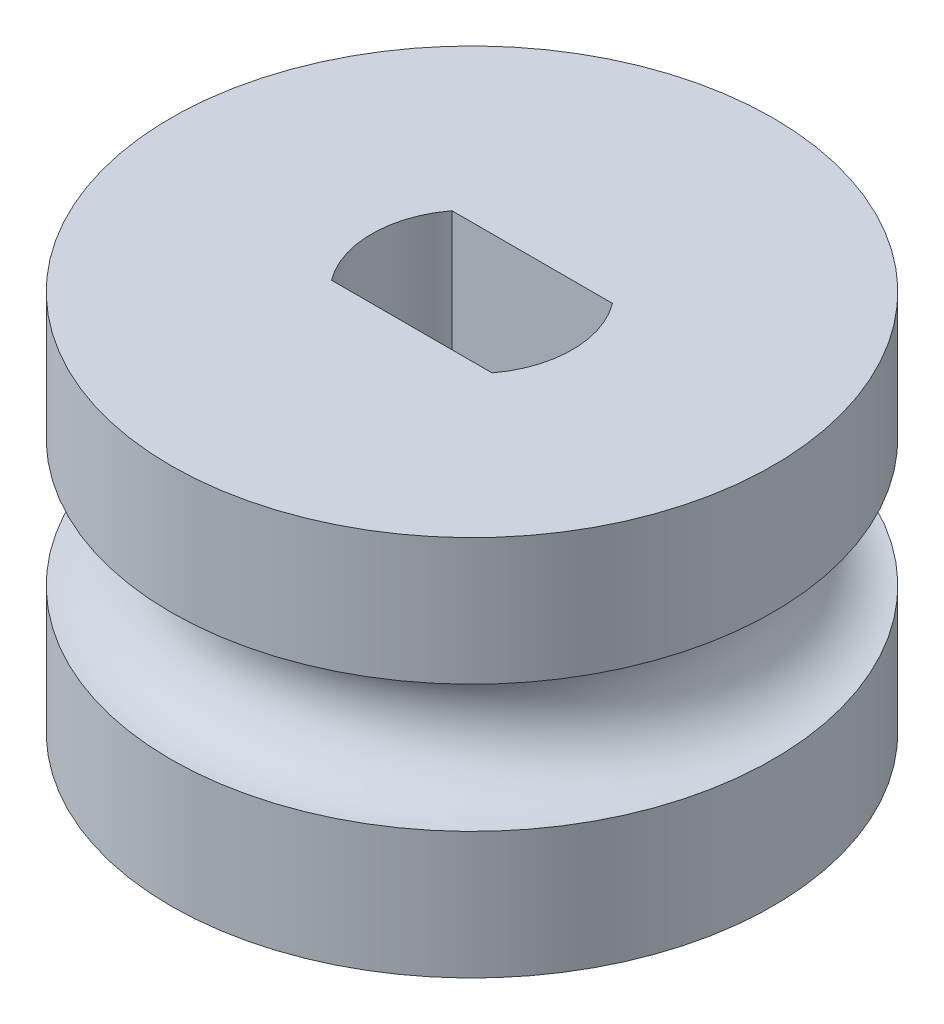
ISO-10303-21;
HEADER;
FILE_DESCRIPTION(('STEP AP214'),'2;1');
FILE_NAME('part.step','',(''),(''),'','','');
FILE_SCHEMA(('AUTOMOTIVE_DESIGN { 1 0 10303 214 1 1 1 1 }'));
ENDSEC;
DATA;
#1=APPLICATION_CONTEXT('core data for automotive mechanical design processes');
#2=APPLICATION_PROTOCOL_DEFINITION('international standard','automotive_design',2000,#1);
#3=PRODUCT_CONTEXT('',#1,'mechanical');
#4=PRODUCT('Part','Part','',(#3));
#5=PRODUCT_RELATED_PRODUCT_CATEGORY('part','',(#4));
#6=PRODUCT_DEFINITION_FORMATION('','',#4);
#7=PRODUCT_DEFINITION_CONTEXT('part definition',#1,'design');
#8=PRODUCT_DEFINITION('design','',#6,#7);
#9=PRODUCT_DEFINITION_SHAPE('','',#8);
#10=(LENGTH_UNIT() NAMED_UNIT(*) SI_UNIT(.MILLI.,.METRE.));
#11=(NAMED_UNIT(*) PLANE_ANGLE_UNIT() SI_UNIT($,.RADIAN.));
#12=(NAMED_UNIT(*) SI_UNIT($,.STERADIAN.) SOLID_ANGLE_UNIT());
#13=UNCERTAINTY_MEASURE_WITH_UNIT(LENGTH_MEASURE(1.E-05),#10,'distance_accuracy_value','');
#14=(GEOMETRIC_REPRESENTATION_CONTEXT(3) GLOBAL_UNCERTAINTY_ASSIGNED_CONTEXT((#13)) GLOBAL_UNIT_ASSIGNED_CONTEXT((#10,
#11,#12)) REPRESENTATION_CONTEXT('',''));
#15=CARTESIAN_POINT('',(0.,0.,0.));
#16=DIRECTION('',(0.,0.,1.));
#17=DIRECTION('',(1.,0.,0.));
#18=AXIS2_PLACEMENT_3D('',#15,#16,#17);
#19=CARTESIAN_POINT('',(0.,9.5,0.));
#20=DIRECTION('',(0.,-1.,0.));
#21=DIRECTION('',(0.,0.,-1.));
#22=AXIS2_PLACEMENT_3D('',#19,#20,#21);
#23=CYLINDRICAL_SURFACE('',#22,7.5);
#24=CARTESIAN_POINT('',(0.,9.5,0.));
#25=DIRECTION('',(0.,1.,0.));
#26=DIRECTION('',(0.,0.,1.));
#27=AXIS2_PLACEMENT_3D('',#24,#25,#26);
#28=CIRCLE('',#27,7.5);
#29=CARTESIAN_POINT('',(0.,9.5,7.5));
#30=VERTEX_POINT('',#29);
#31=EDGE_CURVE('E11',#30,#30,#28,.T.);
#32=ORIENTED_EDGE('',*,*,#31,.F.);
#33=EDGE_LOOP('',(#32));
#34=FACE_BOUND('',#33,.T.);
#35=CARTESIAN_POINT('',(0.,6.3375,0.));
#36=DIRECTION('',(0.,-1.,0.));
#37=DIRECTION('',(0.,0.,-1.));
#38=AXIS2_PLACEMENT_3D('',#35,#36,#37);
#39=CIRCLE('',#38,7.5);
#40=CARTESIAN_POINT('',(0.,6.3375,-7.5));
#41=VERTEX_POINT('',#40);
#42=EDGE_CURVE('E36',#41,#41,#39,.T.);
#43=ORIENTED_EDGE('',*,*,#42,.F.);
#44=EDGE_LOOP('',(#43));
#45=FACE_BOUND('',#44,.T.);
#46=ADVANCED_FACE('F33',(#34,#45),#23,.T.);
#47=CARTESIAN_POINT('',(0.,0.,0.));
#48=DIRECTION('',(0.,1.,0.));
#49=DIRECTION('',(0.,0.,1.));
#50=AXIS2_PLACEMENT_3D('',#47,#48,#49);
#51=CIRCLE('',#50,7.5);
#52=CARTESIAN_POINT('',(0.,0.,7.5));
#53=VERTEX_POINT('',#52);
#54=EDGE_CURVE('E41',#53,#53,#51,.T.);
#55=ORIENTED_EDGE('',*,*,#54,.T.);
#56=EDGE_LOOP('',(#55));
#57=FACE_BOUND('',#56,.T.);
#58=CARTESIAN_POINT('',(0.,3.1625,0.));
#59=DIRECTION('',(0.,1.,0.));
#60=DIRECTION('',(0.,0.,1.));
#61=AXIS2_PLACEMENT_3D('',#58,#59,#60);
#62=CIRCLE('',#61,7.5);
#63=CARTESIAN_POINT('',(0.,3.1625,7.5));
#64=VERTEX_POINT('',#63);
#65=EDGE_CURVE('E112',#64,#64,#62,.T.);
#66=ORIENTED_EDGE('',*,*,#65,.F.);
#67=EDGE_LOOP('',(#66));
#68=FACE_BOUND('',#67,.T.);
#69=ADVANCED_FACE('F122',(#57,#68),#23,.T.);
#70=CARTESIAN_POINT('',(0.,9.5,0.));
#71=DIRECTION('',(0.,1.,0.));
#72=DIRECTION('',(0.,0.,1.));
#73=AXIS2_PLACEMENT_3D('',#70,#71,#72);
#74=PLANE('',#73);
#75=ORIENTED_EDGE('',*,*,#31,.T.);
#76=EDGE_LOOP('',(#75));
#77=FACE_BOUND('',#76,.T.);
#78=DIRECTION('',(1.,0.,0.));
#79=VECTOR('',#78,1.);
#80=CARTESIAN_POINT('',(-2.,9.5,1.5));
#81=LINE('',#80,#79);
#82=CARTESIAN_POINT('',(-2.,9.5,1.5));
#83=VERTEX_POINT('',#82);
#84=CARTESIAN_POINT('',(2.,9.5,1.5));
#85=VERTEX_POINT('',#84);
#86=EDGE_CURVE('E83',#83,#85,#81,.T.);
#87=ORIENTED_EDGE('',*,*,#86,.F.);
#88=CARTESIAN_POINT('',(0.,9.5,0.));
#89=DIRECTION('',(0.,1.,0.));
#90=DIRECTION('',(0.,0.,1.));
#91=AXIS2_PLACEMENT_3D('',#88,#89,#90);
#92=CIRCLE('',#91,2.5);
#93=CARTESIAN_POINT('',(-2.,9.5,-1.5));
#94=VERTEX_POINT('',#93);
#95=EDGE_CURVE('E75',#94,#83,#92,.T.);
#96=ORIENTED_EDGE('',*,*,#95,.F.);
#97=DIRECTION('',(-1.,0.,0.));
#98=VECTOR('',#97,1.);
#99=CARTESIAN_POINT('',(-2.,9.5,-1.5));
#100=LINE('',#99,#98);
#101=CARTESIAN_POINT('',(2.,9.5,-1.5));
#102=VERTEX_POINT('',#101);
#103=EDGE_CURVE('E97',#102,#94,#100,.T.);
#104=ORIENTED_EDGE('',*,*,#103,.F.);
#105=CARTESIAN_POINT('',(0.,9.5,0.));
#106=DIRECTION('',(0.,1.,0.));
#107=DIRECTION('',(0.,0.,1.));
#108=AXIS2_PLACEMENT_3D('',#105,#106,#107);
#109=CIRCLE('',#108,2.5);
#110=EDGE_CURVE('E95',#85,#102,#109,.T.);
#111=ORIENTED_EDGE('',*,*,#110,.F.);
#112=EDGE_LOOP('',(#87,#96,#104,#111));
#113=FACE_BOUND('',#112,.T.);
#114=ADVANCED_FACE('F94',(#77,#113),#74,.T.);
#115=CARTESIAN_POINT('',(0.,0.,0.));
#116=DIRECTION('',(0.,1.,0.));
#117=DIRECTION('',(0.,0.,1.));
#118=AXIS2_PLACEMENT_3D('',#115,#116,#117);
#119=PLANE('',#118);
#120=ORIENTED_EDGE('',*,*,#54,.F.);
#121=EDGE_LOOP('',(#120));
#122=FACE_BOUND('',#121,.T.);
#123=CARTESIAN_POINT('',(0.,0.,0.));
#124=DIRECTION('',(0.,1.,0.));
#125=DIRECTION('',(0.,0.,1.));
#126=AXIS2_PLACEMENT_3D('',#123,#124,#125);
#127=CIRCLE('',#126,2.5);
#128=CARTESIAN_POINT('',(-2.,0.,-1.5));
#129=VERTEX_POINT('',#128);
#130=CARTESIAN_POINT('',(-2.,0.,1.5));
#131=VERTEX_POINT('',#130);
#132=EDGE_CURVE('E57',#129,#131,#127,.T.);
#133=ORIENTED_EDGE('',*,*,#132,.T.);
#134=DIRECTION('',(1.,0.,0.));
#135=VECTOR('',#134,1.);
#136=CARTESIAN_POINT('',(-2.,0.,1.5));
#137=LINE('',#136,#135);
#138=CARTESIAN_POINT('',(2.,0.,1.5));
#139=VERTEX_POINT('',#138);
#140=EDGE_CURVE('E90',#131,#139,#137,.T.);
#141=ORIENTED_EDGE('',*,*,#140,.T.);
#142=CARTESIAN_POINT('',(0.,0.,0.));
#143=DIRECTION('',(0.,1.,0.));
#144=DIRECTION('',(0.,0.,1.));
#145=AXIS2_PLACEMENT_3D('',#142,#143,#144);
#146=CIRCLE('',#145,2.5);
#147=CARTESIAN_POINT('',(2.,0.,-1.5));
#148=VERTEX_POINT('',#147);
#149=EDGE_CURVE('E103',#139,#148,#146,.T.);
#150=ORIENTED_EDGE('',*,*,#149,.T.);
#151=DIRECTION('',(-1.,0.,0.));
#152=VECTOR('',#151,1.);
#153=CARTESIAN_POINT('',(-2.,0.,-1.5));
#154=LINE('',#153,#152);
#155=EDGE_CURVE('E84',#148,#129,#154,.T.);
#156=ORIENTED_EDGE('',*,*,#155,.T.);
#157=EDGE_LOOP('',(#133,#141,#150,#156));
#158=FACE_BOUND('',#157,.T.);
#159=ADVANCED_FACE('F131',(#122,#158),#119,.F.);
#160=CARTESIAN_POINT('',(0.,9.5,0.));
#161=DIRECTION('',(0.,-1.,0.));
#162=DIRECTION('',(0.,0.,-1.));
#163=AXIS2_PLACEMENT_3D('',#160,#161,#162);
#164=CYLINDRICAL_SURFACE('',#163,2.5);
#165=ORIENTED_EDGE('',*,*,#132,.F.);
#166=DIRECTION('',(0.,-1.,0.));
#167=VECTOR('',#166,1.);
#168=CARTESIAN_POINT('',(-2.,9.5,-1.5));
#169=LINE('',#168,#167);
#170=EDGE_CURVE('E79',#94,#129,#169,.T.);
#171=ORIENTED_EDGE('',*,*,#170,.F.);
#172=ORIENTED_EDGE('',*,*,#95,.T.);
#173=DIRECTION('',(0.,-1.,0.));
#174=VECTOR('',#173,1.);
#175=CARTESIAN_POINT('',(-2.,9.5,1.5));
#176=LINE('',#175,#174);
#177=EDGE_CURVE('E78',#83,#131,#176,.T.);
#178=ORIENTED_EDGE('',*,*,#177,.T.);
#179=EDGE_LOOP('',(#165,#171,#172,#178));
#180=FACE_BOUND('',#179,.T.);
#181=ADVANCED_FACE('F77',(#180),#164,.F.);
#182=CARTESIAN_POINT('',(-2.,9.5,1.5));
#183=DIRECTION('',(0.,0.,-1.));
#184=DIRECTION('',(-1.,0.,0.));
#185=AXIS2_PLACEMENT_3D('',#182,#183,#184);
#186=PLANE('',#185);
#187=ORIENTED_EDGE('',*,*,#140,.F.);
#188=ORIENTED_EDGE('',*,*,#177,.F.);
#189=ORIENTED_EDGE('',*,*,#86,.T.);
#190=DIRECTION('',(0.,-1.,0.));
#191=VECTOR('',#190,1.);
#192=CARTESIAN_POINT('',(2.,9.5,1.5));
#193=LINE('',#192,#191);
#194=EDGE_CURVE('E91',#85,#139,#193,.T.);
#195=ORIENTED_EDGE('',*,*,#194,.T.);
#196=EDGE_LOOP('',(#187,#188,#189,#195));
#197=FACE_BOUND('',#196,.T.);
#198=ADVANCED_FACE('F87',(#197),#186,.T.);
#199=CARTESIAN_POINT('',(0.,9.5,0.));
#200=DIRECTION('',(0.,-1.,0.));
#201=DIRECTION('',(0.,0.,-1.));
#202=AXIS2_PLACEMENT_3D('',#199,#200,#201);
#203=CYLINDRICAL_SURFACE('',#202,2.5);
#204=ORIENTED_EDGE('',*,*,#149,.F.);
#205=ORIENTED_EDGE('',*,*,#194,.F.);
#206=ORIENTED_EDGE('',*,*,#110,.T.);
#207=DIRECTION('',(0.,-1.,0.));
#208=VECTOR('',#207,1.);
#209=CARTESIAN_POINT('',(2.,9.5,-1.5));
#210=LINE('',#209,#208);
#211=EDGE_CURVE('E49',#102,#148,#210,.T.);
#212=ORIENTED_EDGE('',*,*,#211,.T.);
#213=EDGE_LOOP('',(#204,#205,#206,#212));
#214=FACE_BOUND('',#213,.T.);
#215=ADVANCED_FACE('F142',(#214),#203,.F.);
#216=CARTESIAN_POINT('',(-2.,9.5,-1.5));
#217=DIRECTION('',(0.,0.,1.));
#218=DIRECTION('',(1.,0.,0.));
#219=AXIS2_PLACEMENT_3D('',#216,#217,#218);
#220=PLANE('',#219);
#221=ORIENTED_EDGE('',*,*,#155,.F.);
#222=ORIENTED_EDGE('',*,*,#211,.F.);
#223=ORIENTED_EDGE('',*,*,#103,.T.);
#224=ORIENTED_EDGE('',*,*,#170,.T.);
#225=EDGE_LOOP('',(#221,#222,#223,#224));
#226=FACE_BOUND('',#225,.T.);
#227=ADVANCED_FACE('F145',(#226),#220,.T.);
#228=CARTESIAN_POINT('',(0.,4.75,0.));
#229=DIRECTION('',(0.,1.,0.));
#230=DIRECTION('',(0.,0.,1.));
#231=AXIS2_PLACEMENT_3D('',#228,#229,#230);
#232=TOROIDAL_SURFACE('',#231,7.5,1.5875);
#233=ORIENTED_EDGE('',*,*,#65,.T.);
#234=EDGE_LOOP('',(#233));
#235=FACE_BOUND('',#234,.T.);
#236=ORIENTED_EDGE('',*,*,#42,.T.);
#237=EDGE_LOOP('',(#236));
#238=FACE_BOUND('',#237,.T.);
#239=ADVANCED_FACE('F119',(#235,#238),#232,.F.);
#240=CLOSED_SHELL('',(#46,#69,#114,#159,#181,#198,#215,#227,#239));
#241=MANIFOLD_SOLID_BREP('B2',#240);
#242=ADVANCED_BREP_SHAPE_REPRESENTATION('',(#18,#241),#14);
#243=SHAPE_DEFINITION_REPRESENTATION(#9,#242);
ENDSEC;
END-ISO-10303-21;
